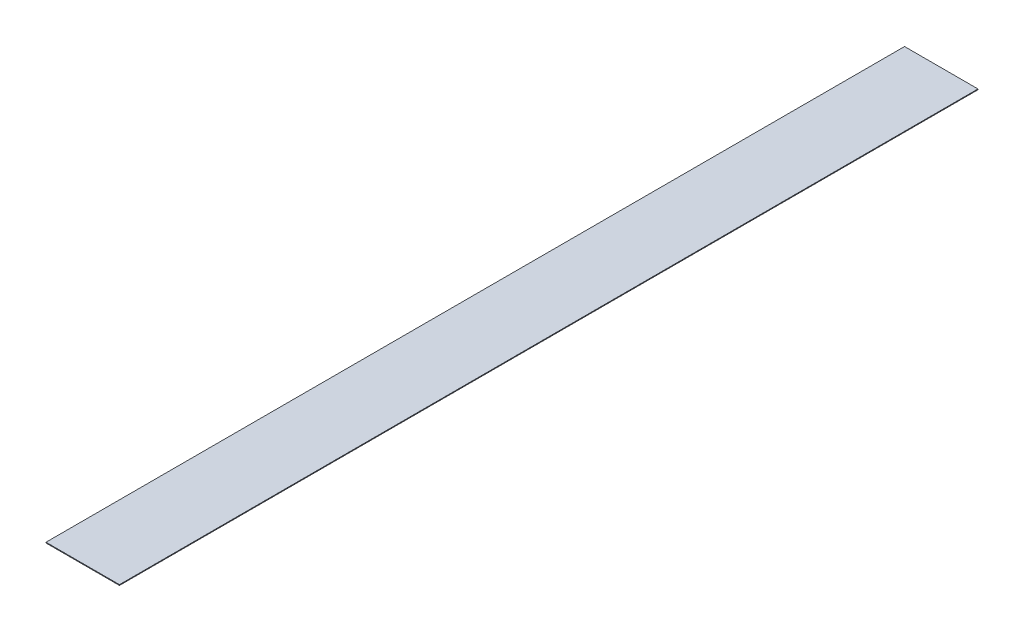
ISO-10303-21;
HEADER;
FILE_DESCRIPTION(('STEP AP214'),'2;1');
FILE_NAME('part.step','',(''),(''),'','','');
FILE_SCHEMA(('AUTOMOTIVE_DESIGN { 1 0 10303 214 1 1 1 1 }'));
ENDSEC;
DATA;
#1=APPLICATION_CONTEXT('core data for automotive mechanical design processes');
#2=APPLICATION_PROTOCOL_DEFINITION('international standard','automotive_design',2000,#1);
#3=PRODUCT_CONTEXT('',#1,'mechanical');
#4=PRODUCT('Part','Part','',(#3));
#5=PRODUCT_RELATED_PRODUCT_CATEGORY('part','',(#4));
#6=PRODUCT_DEFINITION_FORMATION('','',#4);
#7=PRODUCT_DEFINITION_CONTEXT('part definition',#1,'design');
#8=PRODUCT_DEFINITION('design','',#6,#7);
#9=PRODUCT_DEFINITION_SHAPE('','',#8);
#10=(LENGTH_UNIT() NAMED_UNIT(*) SI_UNIT(.MILLI.,.METRE.));
#11=(NAMED_UNIT(*) PLANE_ANGLE_UNIT() SI_UNIT($,.RADIAN.));
#12=(NAMED_UNIT(*) SI_UNIT($,.STERADIAN.) SOLID_ANGLE_UNIT());
#13=UNCERTAINTY_MEASURE_WITH_UNIT(LENGTH_MEASURE(1.E-05),#10,'distance_accuracy_value','');
#14=(GEOMETRIC_REPRESENTATION_CONTEXT(3) GLOBAL_UNCERTAINTY_ASSIGNED_CONTEXT((#13)) GLOBAL_UNIT_ASSIGNED_CONTEXT((#10,
#11,#12)) REPRESENTATION_CONTEXT('',''));
#15=CARTESIAN_POINT('',(0.,0.,0.));
#16=DIRECTION('',(0.,0.,1.));
#17=DIRECTION('',(1.,0.,0.));
#18=AXIS2_PLACEMENT_3D('',#15,#16,#17);
#19=CARTESIAN_POINT('',(-25.4,0.508,0.));
#20=DIRECTION('',(1.,0.,0.));
#21=DIRECTION('',(0.,0.,-1.));
#22=AXIS2_PLACEMENT_3D('',#19,#20,#21);
#23=PLANE('',#22);
#24=DIRECTION('',(0.,0.,1.));
#25=VECTOR('',#24,1.);
#26=CARTESIAN_POINT('',(-25.4,0.,0.));
#27=LINE('',#26,#25);
#28=CARTESIAN_POINT('',(-25.4,0.,-593.725));
#29=VERTEX_POINT('',#28);
#30=CARTESIAN_POINT('',(-25.4,0.,0.));
#31=VERTEX_POINT('',#30);
#32=EDGE_CURVE('E96',#29,#31,#27,.T.);
#33=ORIENTED_EDGE('',*,*,#32,.T.);
#34=DIRECTION('',(0.,-1.,0.));
#35=VECTOR('',#34,1.);
#36=CARTESIAN_POINT('',(-25.4,0.508,0.));
#37=LINE('',#36,#35);
#38=CARTESIAN_POINT('',(-25.4,0.508,0.));
#39=VERTEX_POINT('',#38);
#40=EDGE_CURVE('E11',#39,#31,#37,.T.);
#41=ORIENTED_EDGE('',*,*,#40,.F.);
#42=DIRECTION('',(0.,0.,1.));
#43=VECTOR('',#42,1.);
#44=CARTESIAN_POINT('',(-25.4,0.508,0.));
#45=LINE('',#44,#43);
#46=CARTESIAN_POINT('',(-25.4,0.508,-593.725));
#47=VERTEX_POINT('',#46);
#48=EDGE_CURVE('E84',#47,#39,#45,.T.);
#49=ORIENTED_EDGE('',*,*,#48,.F.);
#50=DIRECTION('',(0.,-1.,0.));
#51=VECTOR('',#50,1.);
#52=CARTESIAN_POINT('',(-25.4,0.508,-593.725));
#53=LINE('',#52,#51);
#54=EDGE_CURVE('E92',#47,#29,#53,.T.);
#55=ORIENTED_EDGE('',*,*,#54,.T.);
#56=EDGE_LOOP('',(#33,#41,#49,#55));
#57=FACE_BOUND('',#56,.T.);
#58=ADVANCED_FACE('F33',(#57),#23,.F.);
#59=CARTESIAN_POINT('',(-25.4,0.508,0.));
#60=DIRECTION('',(0.,0.,-1.));
#61=DIRECTION('',(-1.,0.,0.));
#62=AXIS2_PLACEMENT_3D('',#59,#60,#61);
#63=PLANE('',#62);
#64=DIRECTION('',(1.,0.,0.));
#65=VECTOR('',#64,1.);
#66=CARTESIAN_POINT('',(-25.4,0.,0.));
#67=LINE('',#66,#65);
#68=CARTESIAN_POINT('',(25.4,0.,0.));
#69=VERTEX_POINT('',#68);
#70=EDGE_CURVE('E88',#31,#69,#67,.T.);
#71=ORIENTED_EDGE('',*,*,#70,.T.);
#72=DIRECTION('',(0.,-1.,0.));
#73=VECTOR('',#72,1.);
#74=CARTESIAN_POINT('',(25.4,0.508,0.));
#75=LINE('',#74,#73);
#76=CARTESIAN_POINT('',(25.4,0.508,0.));
#77=VERTEX_POINT('',#76);
#78=EDGE_CURVE('E41',#77,#69,#75,.T.);
#79=ORIENTED_EDGE('',*,*,#78,.F.);
#80=DIRECTION('',(1.,0.,0.));
#81=VECTOR('',#80,1.);
#82=CARTESIAN_POINT('',(-25.4,0.508,0.));
#83=LINE('',#82,#81);
#84=EDGE_CURVE('E79',#39,#77,#83,.T.);
#85=ORIENTED_EDGE('',*,*,#84,.F.);
#86=ORIENTED_EDGE('',*,*,#40,.T.);
#87=EDGE_LOOP('',(#71,#79,#85,#86));
#88=FACE_BOUND('',#87,.T.);
#89=ADVANCED_FACE('F87',(#88),#63,.F.);
#90=CARTESIAN_POINT('',(25.4,0.508,0.));
#91=DIRECTION('',(-1.,0.,0.));
#92=DIRECTION('',(0.,0.,1.));
#93=AXIS2_PLACEMENT_3D('',#90,#91,#92);
#94=PLANE('',#93);
#95=DIRECTION('',(0.,0.,-1.));
#96=VECTOR('',#95,1.);
#97=CARTESIAN_POINT('',(25.4,0.,0.));
#98=LINE('',#97,#96);
#99=CARTESIAN_POINT('',(25.4,0.,-593.725));
#100=VERTEX_POINT('',#99);
#101=EDGE_CURVE('E66',#69,#100,#98,.T.);
#102=ORIENTED_EDGE('',*,*,#101,.T.);
#103=DIRECTION('',(0.,-1.,0.));
#104=VECTOR('',#103,1.);
#105=CARTESIAN_POINT('',(25.4,0.508,-593.725));
#106=LINE('',#105,#104);
#107=CARTESIAN_POINT('',(25.4,0.508,-593.725));
#108=VERTEX_POINT('',#107);
#109=EDGE_CURVE('E89',#108,#100,#106,.T.);
#110=ORIENTED_EDGE('',*,*,#109,.F.);
#111=DIRECTION('',(0.,0.,-1.));
#112=VECTOR('',#111,1.);
#113=CARTESIAN_POINT('',(25.4,0.508,0.));
#114=LINE('',#113,#112);
#115=EDGE_CURVE('E82',#77,#108,#114,.T.);
#116=ORIENTED_EDGE('',*,*,#115,.F.);
#117=ORIENTED_EDGE('',*,*,#78,.T.);
#118=EDGE_LOOP('',(#102,#110,#116,#117));
#119=FACE_BOUND('',#118,.T.);
#120=ADVANCED_FACE('F90',(#119),#94,.F.);
#121=CARTESIAN_POINT('',(-25.4,0.508,-593.725));
#122=DIRECTION('',(0.,0.,1.));
#123=DIRECTION('',(1.,0.,0.));
#124=AXIS2_PLACEMENT_3D('',#121,#122,#123);
#125=PLANE('',#124);
#126=DIRECTION('',(-1.,0.,0.));
#127=VECTOR('',#126,1.);
#128=CARTESIAN_POINT('',(-25.4,0.,-593.725));
#129=LINE('',#128,#127);
#130=EDGE_CURVE('E72',#100,#29,#129,.T.);
#131=ORIENTED_EDGE('',*,*,#130,.T.);
#132=ORIENTED_EDGE('',*,*,#54,.F.);
#133=DIRECTION('',(-1.,0.,0.));
#134=VECTOR('',#133,1.);
#135=CARTESIAN_POINT('',(-25.4,0.508,-593.725));
#136=LINE('',#135,#134);
#137=EDGE_CURVE('E49',#108,#47,#136,.T.);
#138=ORIENTED_EDGE('',*,*,#137,.F.);
#139=ORIENTED_EDGE('',*,*,#109,.T.);
#140=EDGE_LOOP('',(#131,#132,#138,#139));
#141=FACE_BOUND('',#140,.T.);
#142=ADVANCED_FACE('F103',(#141),#125,.F.);
#143=CARTESIAN_POINT('',(0.,0.508,0.));
#144=DIRECTION('',(0.,-1.,0.));
#145=DIRECTION('',(0.,0.,-1.));
#146=AXIS2_PLACEMENT_3D('',#143,#144,#145);
#147=PLANE('',#146);
#148=ORIENTED_EDGE('',*,*,#48,.T.);
#149=ORIENTED_EDGE('',*,*,#84,.T.);
#150=ORIENTED_EDGE('',*,*,#115,.T.);
#151=ORIENTED_EDGE('',*,*,#137,.T.);
#152=EDGE_LOOP('',(#148,#149,#150,#151));
#153=FACE_BOUND('',#152,.T.);
#154=ADVANCED_FACE('F80',(#153),#147,.F.);
#155=CARTESIAN_POINT('',(0.,0.,0.));
#156=DIRECTION('',(0.,-1.,0.));
#157=DIRECTION('',(0.,0.,-1.));
#158=AXIS2_PLACEMENT_3D('',#155,#156,#157);
#159=PLANE('',#158);
#160=ORIENTED_EDGE('',*,*,#32,.F.);
#161=ORIENTED_EDGE('',*,*,#130,.F.);
#162=ORIENTED_EDGE('',*,*,#101,.F.);
#163=ORIENTED_EDGE('',*,*,#70,.F.);
#164=EDGE_LOOP('',(#160,#161,#162,#163));
#165=FACE_BOUND('',#164,.T.);
#166=ADVANCED_FACE('F106',(#165),#159,.T.);
#167=CLOSED_SHELL('',(#58,#89,#120,#142,#154,#166));
#168=MANIFOLD_SOLID_BREP('B2',#167);
#169=ADVANCED_BREP_SHAPE_REPRESENTATION('',(#18,#168),#14);
#170=SHAPE_DEFINITION_REPRESENTATION(#9,#169);
ENDSEC;
END-ISO-10303-21;
